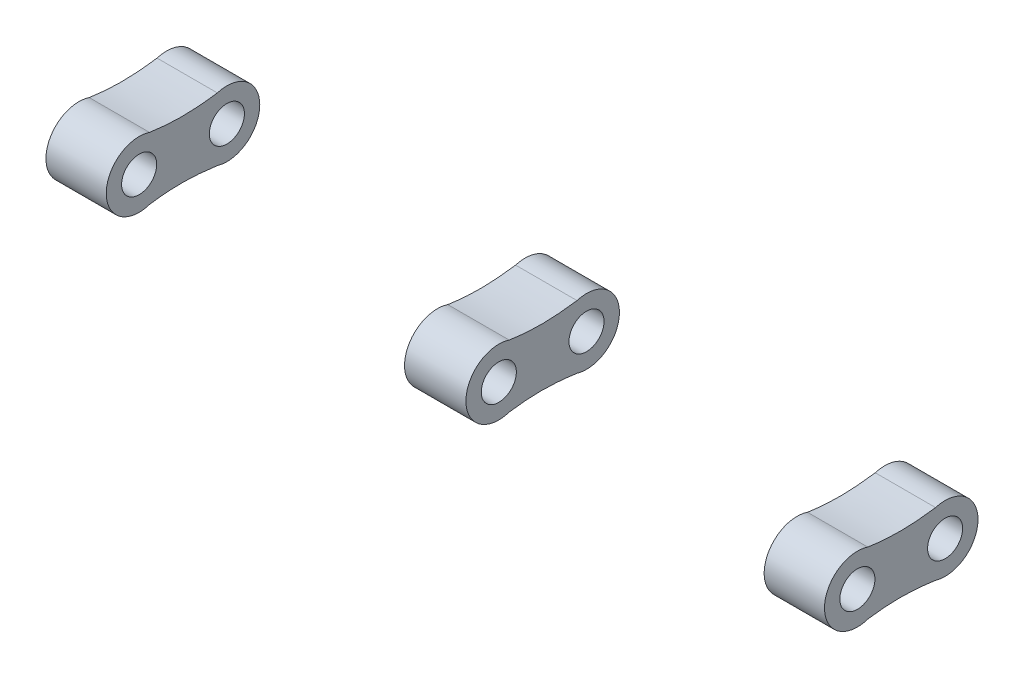
ISO-10303-21;
HEADER;
FILE_DESCRIPTION(('STEP AP214'),'2;1');
FILE_NAME('part.step','',(''),(''),'','','');
FILE_SCHEMA(('AUTOMOTIVE_DESIGN { 1 0 10303 214 1 1 1 1 }'));
ENDSEC;
DATA;
#1=APPLICATION_CONTEXT('core data for automotive mechanical design processes');
#2=APPLICATION_PROTOCOL_DEFINITION('international standard','automotive_design',2000,#1);
#3=PRODUCT_CONTEXT('',#1,'mechanical');
#4=PRODUCT('Part','Part','',(#3));
#5=PRODUCT_RELATED_PRODUCT_CATEGORY('part','',(#4));
#6=PRODUCT_DEFINITION_FORMATION('','',#4);
#7=PRODUCT_DEFINITION_CONTEXT('part definition',#1,'design');
#8=PRODUCT_DEFINITION('design','',#6,#7);
#9=PRODUCT_DEFINITION_SHAPE('','',#8);
#10=(LENGTH_UNIT() NAMED_UNIT(*) SI_UNIT(.MILLI.,.METRE.));
#11=(NAMED_UNIT(*) PLANE_ANGLE_UNIT() SI_UNIT($,.RADIAN.));
#12=(NAMED_UNIT(*) SI_UNIT($,.STERADIAN.) SOLID_ANGLE_UNIT());
#13=UNCERTAINTY_MEASURE_WITH_UNIT(LENGTH_MEASURE(1.E-05),#10,'distance_accuracy_value','');
#14=(GEOMETRIC_REPRESENTATION_CONTEXT(3) GLOBAL_UNCERTAINTY_ASSIGNED_CONTEXT((#13)) GLOBAL_UNIT_ASSIGNED_CONTEXT((#10,
#11,#12)) REPRESENTATION_CONTEXT('',''));
#15=CARTESIAN_POINT('',(0.,0.,0.));
#16=DIRECTION('',(0.,0.,1.));
#17=DIRECTION('',(1.,0.,0.));
#18=AXIS2_PLACEMENT_3D('',#15,#16,#17);
#19=CARTESIAN_POINT('',(4.50788655293066,0.,-3.5));
#20=DIRECTION('',(-1.,0.,0.));
#21=DIRECTION('',(0.,0.,1.));
#22=AXIS2_PLACEMENT_3D('',#19,#20,#21);
#23=CYLINDRICAL_SURFACE('',#22,0.4);
#24=CARTESIAN_POINT('',(-0.7,0.,-3.5));
#25=DIRECTION('',(1.,0.,0.));
#26=DIRECTION('',(0.,0.,-1.));
#27=AXIS2_PLACEMENT_3D('',#24,#25,#26);
#28=CIRCLE('',#27,0.4);
#29=CARTESIAN_POINT('',(-0.7,0.,-3.9));
#30=VERTEX_POINT('',#29);
#31=EDGE_CURVE('E123',#30,#30,#28,.T.);
#32=ORIENTED_EDGE('',*,*,#31,.F.);
#33=EDGE_LOOP('',(#32));
#34=FACE_BOUND('',#33,.T.);
#35=CARTESIAN_POINT('',(0.7,0.,-3.5));
#36=DIRECTION('',(1.,0.,0.));
#37=DIRECTION('',(0.,0.,-1.));
#38=AXIS2_PLACEMENT_3D('',#35,#36,#37);
#39=CIRCLE('',#38,0.4);
#40=CARTESIAN_POINT('',(0.7,0.,-3.9));
#41=VERTEX_POINT('',#40);
#42=EDGE_CURVE('E104',#41,#41,#39,.T.);
#43=ORIENTED_EDGE('',*,*,#42,.T.);
#44=EDGE_LOOP('',(#43));
#45=FACE_BOUND('',#44,.T.);
#46=ADVANCED_FACE('F43',(#34,#45),#23,.F.);
#47=CARTESIAN_POINT('',(4.50788655293066,0.,-3.5));
#48=DIRECTION('',(-1.,0.,0.));
#49=DIRECTION('',(0.,0.,1.));
#50=AXIS2_PLACEMENT_3D('',#47,#48,#49);
#51=CYLINDRICAL_SURFACE('',#50,0.749999999998612);
#52=CARTESIAN_POINT('',(0.7,0.,-3.5));
#53=DIRECTION('',(1.,0.,0.));
#54=DIRECTION('',(0.,0.,-1.));
#55=AXIS2_PLACEMENT_3D('',#52,#53,#54);
#56=CIRCLE('',#55,0.749999999998612);
#57=CARTESIAN_POINT('',(0.7,-0.71798439311027,-3.28320883032744));
#58=VERTEX_POINT('',#57);
#59=CARTESIAN_POINT('',(0.7,0.717984393110274,-3.28320883032746));
#60=VERTEX_POINT('',#59);
#61=EDGE_CURVE('E89',#58,#60,#56,.T.);
#62=ORIENTED_EDGE('',*,*,#61,.F.);
#63=DIRECTION('',(-1.,0.,0.));
#64=VECTOR('',#63,1.);
#65=CARTESIAN_POINT('',(4.50788655293066,-0.71798439311027,-3.28320883032744));
#66=LINE('',#65,#64);
#67=CARTESIAN_POINT('',(-0.7,-0.71798439311027,-3.28320883032744));
#68=VERTEX_POINT('',#67);
#69=EDGE_CURVE('E60',#58,#68,#66,.T.);
#70=ORIENTED_EDGE('',*,*,#69,.T.);
#71=CARTESIAN_POINT('',(-0.7,0.,-3.5));
#72=DIRECTION('',(1.,0.,0.));
#73=DIRECTION('',(0.,0.,-1.));
#74=AXIS2_PLACEMENT_3D('',#71,#72,#73);
#75=CIRCLE('',#74,0.749999999998612);
#76=CARTESIAN_POINT('',(-0.7,0.717984393110274,-3.28320883032746));
#77=VERTEX_POINT('',#76);
#78=EDGE_CURVE('E92',#68,#77,#75,.T.);
#79=ORIENTED_EDGE('',*,*,#78,.T.);
#80=DIRECTION('',(-1.,0.,0.));
#81=VECTOR('',#80,1.);
#82=CARTESIAN_POINT('',(4.50788655293066,0.717984393110274,-3.28320883032746));
#83=LINE('',#82,#81);
#84=EDGE_CURVE('E85',#60,#77,#83,.T.);
#85=ORIENTED_EDGE('',*,*,#84,.F.);
#86=EDGE_LOOP('',(#62,#70,#79,#85));
#87=FACE_BOUND('',#86,.T.);
#88=ADVANCED_FACE('F87',(#87),#51,.T.);
#89=CARTESIAN_POINT('',(4.50788655293066,-0.711356359117423,-1.7376386549852));
#90=CARTESIAN_POINT('',(4.50788655293066,-0.628628531625832,-2.30473789186206));
#91=CARTESIAN_POINT('',(4.50788655293066,-0.640882332408788,-2.7257143253079));
#92=CARTESIAN_POINT('',(4.50788655293066,-0.71798439311027,-3.28320883032744));
#93=B_SPLINE_CURVE_WITH_KNOTS('',3,(#89,#90,#91,#92),.UNSPECIFIED.,.F.,.F.,(4,4),
(0.106827286541516,0.900451134751873),.UNSPECIFIED.);
#94=DIRECTION('',(-1.,0.,0.));
#95=VECTOR('',#94,1.);
#96=SURFACE_OF_LINEAR_EXTRUSION('',#93,#95);
#97=CARTESIAN_POINT('',(0.7,-0.711356359117423,-1.7376386549852));
#98=CARTESIAN_POINT('',(0.7,-0.628628531625832,-2.30473789186206));
#99=CARTESIAN_POINT('',(0.7,-0.640882332408788,-2.7257143253079));
#100=CARTESIAN_POINT('',(0.7,-0.71798439311027,-3.28320883032744));
#101=B_SPLINE_CURVE_WITH_KNOTS('',3,(#97,#98,#99,#100),.UNSPECIFIED.,.F.,.F.,(4,4),
(0.106827286541516,0.900451134751873),.UNSPECIFIED.);
#102=CARTESIAN_POINT('',(0.7,-0.711356359117431,-1.73763865498521));
#103=VERTEX_POINT('',#102);
#104=EDGE_CURVE('E103',#103,#58,#101,.T.);
#105=ORIENTED_EDGE('',*,*,#104,.F.);
#106=DIRECTION('',(-1.,0.,0.));
#107=VECTOR('',#106,1.);
#108=CARTESIAN_POINT('',(4.50788655293066,-0.711356359117431,-1.73763865498521));
#109=LINE('',#108,#107);
#110=CARTESIAN_POINT('',(-0.7,-0.711356359117431,-1.73763865498521));
#111=VERTEX_POINT('',#110);
#112=EDGE_CURVE('E53',#103,#111,#109,.T.);
#113=ORIENTED_EDGE('',*,*,#112,.T.);
#114=CARTESIAN_POINT('',(-0.7,-0.711356359117423,-1.7376386549852));
#115=CARTESIAN_POINT('',(-0.7,-0.628628531625832,-2.30473789186206));
#116=CARTESIAN_POINT('',(-0.7,-0.640882332408788,-2.7257143253079));
#117=CARTESIAN_POINT('',(-0.7,-0.71798439311027,-3.28320883032744));
#118=B_SPLINE_CURVE_WITH_KNOTS('',3,(#114,#115,#116,#117),.UNSPECIFIED.,.F.,.F.,(4,4),
(0.106827286541516,0.900451134751873),.UNSPECIFIED.);
#119=EDGE_CURVE('E227',#111,#68,#118,.T.);
#120=ORIENTED_EDGE('',*,*,#119,.T.);
#121=ORIENTED_EDGE('',*,*,#69,.F.);
#122=EDGE_LOOP('',(#105,#113,#120,#121));
#123=FACE_BOUND('',#122,.T.);
#124=ADVANCED_FACE('F144',(#123),#96,.F.);
#125=CARTESIAN_POINT('',(4.50788655293066,0.,-1.5));
#126=DIRECTION('',(-1.,0.,0.));
#127=DIRECTION('',(0.,0.,1.));
#128=AXIS2_PLACEMENT_3D('',#125,#126,#127);
#129=CYLINDRICAL_SURFACE('',#128,0.749999999999991);
#130=CARTESIAN_POINT('',(0.7,0.,-1.5));
#131=DIRECTION('',(1.,0.,0.));
#132=DIRECTION('',(0.,0.,-1.));
#133=AXIS2_PLACEMENT_3D('',#130,#131,#132);
#134=CIRCLE('',#133,0.749999999999991);
#135=CARTESIAN_POINT('',(0.7,0.7113563591174,-1.7376386549853));
#136=VERTEX_POINT('',#135);
#137=EDGE_CURVE('E67',#136,#103,#134,.T.);
#138=ORIENTED_EDGE('',*,*,#137,.F.);
#139=DIRECTION('',(-1.,0.,0.));
#140=VECTOR('',#139,1.);
#141=CARTESIAN_POINT('',(4.50788655293066,0.7113563591174,-1.7376386549853));
#142=LINE('',#141,#140);
#143=CARTESIAN_POINT('',(-0.7,0.7113563591174,-1.7376386549853));
#144=VERTEX_POINT('',#143);
#145=EDGE_CURVE('E12',#136,#144,#142,.T.);
#146=ORIENTED_EDGE('',*,*,#145,.T.);
#147=CARTESIAN_POINT('',(-0.7,0.,-1.5));
#148=DIRECTION('',(1.,0.,0.));
#149=DIRECTION('',(0.,0.,-1.));
#150=AXIS2_PLACEMENT_3D('',#147,#148,#149);
#151=CIRCLE('',#150,0.749999999999991);
#152=EDGE_CURVE('E226',#144,#111,#151,.T.);
#153=ORIENTED_EDGE('',*,*,#152,.T.);
#154=ORIENTED_EDGE('',*,*,#112,.F.);
#155=EDGE_LOOP('',(#138,#146,#153,#154));
#156=FACE_BOUND('',#155,.T.);
#157=ADVANCED_FACE('F147',(#156),#129,.T.);
#158=CARTESIAN_POINT('',(4.50788655293066,0.717984393110272,-3.28320883032746));
#159=CARTESIAN_POINT('',(4.50788655293066,0.640882332408786,-2.72571432530796));
#160=CARTESIAN_POINT('',(4.50788655293066,0.628628531625817,-2.30473789186215));
#161=CARTESIAN_POINT('',(4.50788655293066,0.711356359117408,-1.7376386549853));
#162=B_SPLINE_CURVE_WITH_KNOTS('',3,(#158,#159,#160,#161),.UNSPECIFIED.,.F.,.F.,(4,4),
(0.106827286541515,0.900451134751871),.UNSPECIFIED.);
#163=DIRECTION('',(-1.,0.,0.));
#164=VECTOR('',#163,1.);
#165=SURFACE_OF_LINEAR_EXTRUSION('',#162,#164);
#166=CARTESIAN_POINT('',(0.700000000000001,0.717984393110272,-3.28320883032746));
#167=CARTESIAN_POINT('',(0.700000000000001,0.640882332408786,-2.72571432530796));
#168=CARTESIAN_POINT('',(0.700000000000001,0.628628531625817,-2.30473789186215));
#169=CARTESIAN_POINT('',(0.700000000000001,0.711356359117408,-1.7376386549853));
#170=B_SPLINE_CURVE_WITH_KNOTS('',3,(#166,#167,#168,#169),.UNSPECIFIED.,.F.,.F.,(4,4),
(0.106827286541515,0.900451134751871),.UNSPECIFIED.);
#171=EDGE_CURVE('E98',#60,#136,#170,.T.);
#172=ORIENTED_EDGE('',*,*,#171,.F.);
#173=ORIENTED_EDGE('',*,*,#84,.T.);
#174=CARTESIAN_POINT('',(-0.7,0.717984393110272,-3.28320883032746));
#175=CARTESIAN_POINT('',(-0.7,0.640882332408786,-2.72571432530796));
#176=CARTESIAN_POINT('',(-0.7,0.628628531625817,-2.30473789186215));
#177=CARTESIAN_POINT('',(-0.7,0.711356359117408,-1.7376386549853));
#178=B_SPLINE_CURVE_WITH_KNOTS('',3,(#174,#175,#176,#177),.UNSPECIFIED.,.F.,.F.,(4,4),
(0.106827286541515,0.900451134751871),.UNSPECIFIED.);
#179=EDGE_CURVE('E125',#77,#144,#178,.T.);
#180=ORIENTED_EDGE('',*,*,#179,.T.);
#181=ORIENTED_EDGE('',*,*,#145,.F.);
#182=EDGE_LOOP('',(#172,#173,#180,#181));
#183=FACE_BOUND('',#182,.T.);
#184=ADVANCED_FACE('F45',(#183),#165,.F.);
#185=CARTESIAN_POINT('',(-0.7,0.654734168041436,-2.51402551710288));
#186=DIRECTION('',(1.,0.,0.));
#187=DIRECTION('',(0.,0.,-1.));
#188=AXIS2_PLACEMENT_3D('',#185,#186,#187);
#189=PLANE('',#188);
#190=ORIENTED_EDGE('',*,*,#179,.F.);
#191=ORIENTED_EDGE('',*,*,#78,.F.);
#192=ORIENTED_EDGE('',*,*,#119,.F.);
#193=ORIENTED_EDGE('',*,*,#152,.F.);
#194=EDGE_LOOP('',(#190,#191,#192,#193));
#195=FACE_BOUND('',#194,.T.);
#196=ORIENTED_EDGE('',*,*,#31,.T.);
#197=EDGE_LOOP('',(#196));
#198=FACE_BOUND('',#197,.T.);
#199=CARTESIAN_POINT('',(-0.7,0.,-1.5));
#200=DIRECTION('',(1.,0.,0.));
#201=DIRECTION('',(0.,0.,-1.));
#202=AXIS2_PLACEMENT_3D('',#199,#200,#201);
#203=CIRCLE('',#202,0.4);
#204=CARTESIAN_POINT('',(-0.7,0.,-1.9));
#205=VERTEX_POINT('',#204);
#206=EDGE_CURVE('E100',#205,#205,#203,.T.);
#207=ORIENTED_EDGE('',*,*,#206,.T.);
#208=EDGE_LOOP('',(#207));
#209=FACE_BOUND('',#208,.T.);
#210=ADVANCED_FACE('F153',(#195,#198,#209),#189,.F.);
#211=CARTESIAN_POINT('',(4.50788655293066,0.,-1.5));
#212=DIRECTION('',(-1.,0.,0.));
#213=DIRECTION('',(0.,0.,1.));
#214=AXIS2_PLACEMENT_3D('',#211,#212,#213);
#215=CYLINDRICAL_SURFACE('',#214,0.4);
#216=ORIENTED_EDGE('',*,*,#206,.F.);
#217=EDGE_LOOP('',(#216));
#218=FACE_BOUND('',#217,.T.);
#219=CARTESIAN_POINT('',(0.7,0.,-1.5));
#220=DIRECTION('',(1.,0.,0.));
#221=DIRECTION('',(0.,0.,-1.));
#222=AXIS2_PLACEMENT_3D('',#219,#220,#221);
#223=CIRCLE('',#222,0.4);
#224=CARTESIAN_POINT('',(0.7,0.,-1.9));
#225=VERTEX_POINT('',#224);
#226=EDGE_CURVE('E48',#225,#225,#223,.T.);
#227=ORIENTED_EDGE('',*,*,#226,.T.);
#228=EDGE_LOOP('',(#227));
#229=FACE_BOUND('',#228,.T.);
#230=ADVANCED_FACE('F163',(#218,#229),#215,.F.);
#231=CARTESIAN_POINT('',(0.7,-10.,-5.));
#232=DIRECTION('',(1.,0.,0.));
#233=DIRECTION('',(0.,0.,-1.));
#234=AXIS2_PLACEMENT_3D('',#231,#232,#233);
#235=PLANE('',#234);
#236=ORIENTED_EDGE('',*,*,#226,.F.);
#237=EDGE_LOOP('',(#236));
#238=FACE_BOUND('',#237,.T.);
#239=ORIENTED_EDGE('',*,*,#42,.F.);
#240=EDGE_LOOP('',(#239));
#241=FACE_BOUND('',#240,.T.);
#242=ORIENTED_EDGE('',*,*,#61,.T.);
#243=ORIENTED_EDGE('',*,*,#171,.T.);
#244=ORIENTED_EDGE('',*,*,#137,.T.);
#245=ORIENTED_EDGE('',*,*,#104,.T.);
#246=EDGE_LOOP('',(#242,#243,#244,#245));
#247=FACE_BOUND('',#246,.T.);
#248=ADVANCED_FACE('F102',(#238,#241,#247),#235,.T.);
#249=CLOSED_SHELL('',(#46,#88,#124,#157,#184,#210,#230,#248));
#250=MANIFOLD_SOLID_BREP('B2',#249);
#251=CARTESIAN_POINT('',(-7.5,-0.654734168041444,-2.51402551710281));
#252=DIRECTION('',(-1.,0.,0.));
#253=DIRECTION('',(0.,0.,1.));
#254=AXIS2_PLACEMENT_3D('',#251,#252,#253);
#255=PLANE('',#254);
#256=CARTESIAN_POINT('',(-7.5,-0.71798439311027,-3.28320883032744));
#257=CARTESIAN_POINT('',(-7.5,-0.640882332408788,-2.7257143253079));
#258=CARTESIAN_POINT('',(-7.5,-0.628628531625832,-2.30473789186206));
#259=CARTESIAN_POINT('',(-7.5,-0.711356359117423,-1.7376386549852));
#260=B_SPLINE_CURVE_WITH_KNOTS('',3,(#256,#257,#258,#259),.UNSPECIFIED.,.F.,.F.,(4,4),
(0.106827286541516,0.900451134751873),.UNSPECIFIED.);
#261=CARTESIAN_POINT('',(-7.5,-0.717984393110269,-3.28320883032744));
#262=VERTEX_POINT('',#261);
#263=CARTESIAN_POINT('',(-7.5,-0.711356359117431,-1.73763865498521));
#264=VERTEX_POINT('',#263);
#265=EDGE_CURVE('E310',#262,#264,#260,.T.);
#266=ORIENTED_EDGE('',*,*,#265,.F.);
#267=CARTESIAN_POINT('',(-7.5,0.,-3.5));
#268=DIRECTION('',(-1.,0.,0.));
#269=DIRECTION('',(0.,0.,1.));
#270=AXIS2_PLACEMENT_3D('',#267,#268,#269);
#271=CIRCLE('',#270,0.749999999998611);
#272=CARTESIAN_POINT('',(-7.5,0.717984393110272,-3.28320883032746));
#273=VERTEX_POINT('',#272);
#274=EDGE_CURVE('E336',#273,#262,#271,.T.);
#275=ORIENTED_EDGE('',*,*,#274,.F.);
#276=CARTESIAN_POINT('',(-7.5,0.711356359117408,-1.7376386549853));
#277=CARTESIAN_POINT('',(-7.5,0.628628531625817,-2.30473789186215));
#278=CARTESIAN_POINT('',(-7.5,0.640882332408786,-2.72571432530796));
#279=CARTESIAN_POINT('',(-7.5,0.717984393110272,-3.28320883032746));
#280=B_SPLINE_CURVE_WITH_KNOTS('',3,(#276,#277,#278,#279),.UNSPECIFIED.,.F.,.F.,(4,4),
(0.106827286541515,0.900451134751871),.UNSPECIFIED.);
#281=CARTESIAN_POINT('',(-7.5,0.7113563591174,-1.7376386549853));
#282=VERTEX_POINT('',#281);
#283=EDGE_CURVE('E311',#282,#273,#280,.T.);
#284=ORIENTED_EDGE('',*,*,#283,.F.);
#285=CARTESIAN_POINT('',(-7.5,0.,-1.5));
#286=DIRECTION('',(-1.,0.,0.));
#287=DIRECTION('',(0.,0.,1.));
#288=AXIS2_PLACEMENT_3D('',#285,#286,#287);
#289=CIRCLE('',#288,0.749999999999991);
#290=EDGE_CURVE('E300',#264,#282,#289,.T.);
#291=ORIENTED_EDGE('',*,*,#290,.F.);
#292=EDGE_LOOP('',(#266,#275,#284,#291));
#293=FACE_BOUND('',#292,.T.);
#294=CARTESIAN_POINT('',(-7.5,0.,-3.5));
#295=DIRECTION('',(-1.,0.,0.));
#296=DIRECTION('',(0.,0.,1.));
#297=AXIS2_PLACEMENT_3D('',#294,#295,#296);
#298=CIRCLE('',#297,0.4);
#299=CARTESIAN_POINT('',(-7.5,0.,-3.1));
#300=VERTEX_POINT('',#299);
#301=EDGE_CURVE('E325',#300,#300,#298,.T.);
#302=ORIENTED_EDGE('',*,*,#301,.T.);
#303=EDGE_LOOP('',(#302));
#304=FACE_BOUND('',#303,.T.);
#305=CARTESIAN_POINT('',(-7.5,0.,-1.5));
#306=DIRECTION('',(-1.,0.,0.));
#307=DIRECTION('',(0.,0.,1.));
#308=AXIS2_PLACEMENT_3D('',#305,#306,#307);
#309=CIRCLE('',#308,0.4);
#310=CARTESIAN_POINT('',(-7.5,0.,-1.1));
#311=VERTEX_POINT('',#310);
#312=EDGE_CURVE('E331',#311,#311,#309,.T.);
#313=ORIENTED_EDGE('',*,*,#312,.T.);
#314=EDGE_LOOP('',(#313));
#315=FACE_BOUND('',#314,.T.);
#316=ADVANCED_FACE('F251',(#293,#304,#315),#255,.F.);
#317=CARTESIAN_POINT('',(-12.6828865529307,-0.71798439311027,-3.28320883032744));
#318=CARTESIAN_POINT('',(-12.6828865529307,-0.640882332408788,-2.7257143253079));
#319=CARTESIAN_POINT('',(-12.6828865529307,-0.628628531625832,-2.30473789186206));
#320=CARTESIAN_POINT('',(-12.6828865529307,-0.711356359117423,-1.7376386549852));
#321=B_SPLINE_CURVE_WITH_KNOTS('',3,(#317,#318,#319,#320),.UNSPECIFIED.,.F.,.F.,(4,4),
(0.106827286541516,0.900451134751873),.UNSPECIFIED.);
#322=DIRECTION('',(1.,0.,0.));
#323=VECTOR('',#322,1.);
#324=SURFACE_OF_LINEAR_EXTRUSION('',#321,#323);
#325=DIRECTION('',(1.,0.,0.));
#326=VECTOR('',#325,1.);
#327=CARTESIAN_POINT('',(-12.6828865529307,-0.711356359117431,-1.73763865498521));
#328=LINE('',#327,#326);
#329=CARTESIAN_POINT('',(-8.875,-0.711356359117431,-1.73763865498521));
#330=VERTEX_POINT('',#329);
#331=EDGE_CURVE('E297',#330,#264,#328,.T.);
#332=ORIENTED_EDGE('',*,*,#331,.F.);
#333=CARTESIAN_POINT('',(-8.875,-0.71798439311027,-3.28320883032744));
#334=CARTESIAN_POINT('',(-8.875,-0.640882332408788,-2.7257143253079));
#335=CARTESIAN_POINT('',(-8.875,-0.628628531625832,-2.30473789186206));
#336=CARTESIAN_POINT('',(-8.875,-0.711356359117423,-1.7376386549852));
#337=B_SPLINE_CURVE_WITH_KNOTS('',3,(#333,#334,#335,#336),.UNSPECIFIED.,.F.,.F.,(4,4),
(0.106827286541516,0.900451134751873),.UNSPECIFIED.);
#338=CARTESIAN_POINT('',(-8.875,-0.717984393110269,-3.28320883032744));
#339=VERTEX_POINT('',#338);
#340=EDGE_CURVE('E272',#330,#339,#337,.F.);
#341=ORIENTED_EDGE('',*,*,#340,.T.);
#342=DIRECTION('',(1.,0.,0.));
#343=VECTOR('',#342,1.);
#344=CARTESIAN_POINT('',(-12.6828865529307,-0.717984393110269,-3.28320883032744));
#345=LINE('',#344,#343);
#346=EDGE_CURVE('E316',#339,#262,#345,.T.);
#347=ORIENTED_EDGE('',*,*,#346,.T.);
#348=ORIENTED_EDGE('',*,*,#265,.T.);
#349=EDGE_LOOP('',(#332,#341,#347,#348));
#350=FACE_BOUND('',#349,.T.);
#351=ADVANCED_FACE('F314',(#350),#324,.F.);
#352=CARTESIAN_POINT('',(-12.6828865529307,0.,-1.5));
#353=DIRECTION('',(1.,0.,0.));
#354=DIRECTION('',(0.,0.,-1.));
#355=AXIS2_PLACEMENT_3D('',#352,#353,#354);
#356=CYLINDRICAL_SURFACE('',#355,0.749999999999991);
#357=DIRECTION('',(1.,0.,0.));
#358=VECTOR('',#357,1.);
#359=CARTESIAN_POINT('',(-12.6828865529307,0.7113563591174,-1.7376386549853));
#360=LINE('',#359,#358);
#361=CARTESIAN_POINT('',(-8.875,0.711356359117408,-1.7376386549853));
#362=VERTEX_POINT('',#361);
#363=EDGE_CURVE('E292',#362,#282,#360,.T.);
#364=ORIENTED_EDGE('',*,*,#363,.F.);
#365=CARTESIAN_POINT('',(-8.875,0.,-1.5));
#366=DIRECTION('',(1.,0.,0.));
#367=DIRECTION('',(0.,0.,-1.));
#368=AXIS2_PLACEMENT_3D('',#365,#366,#367);
#369=CIRCLE('',#368,0.749999999999991);
#370=EDGE_CURVE('E302',#362,#330,#369,.T.);
#371=ORIENTED_EDGE('',*,*,#370,.T.);
#372=ORIENTED_EDGE('',*,*,#331,.T.);
#373=ORIENTED_EDGE('',*,*,#290,.T.);
#374=EDGE_LOOP('',(#364,#371,#372,#373));
#375=FACE_BOUND('',#374,.T.);
#376=ADVANCED_FACE('F299',(#375),#356,.T.);
#377=CARTESIAN_POINT('',(-12.6828865529307,0.711356359117408,-1.7376386549853));
#378=CARTESIAN_POINT('',(-12.6828865529307,0.628628531625817,-2.30473789186215));
#379=CARTESIAN_POINT('',(-12.6828865529307,0.640882332408786,-2.72571432530796));
#380=CARTESIAN_POINT('',(-12.6828865529307,0.717984393110272,-3.28320883032746));
#381=B_SPLINE_CURVE_WITH_KNOTS('',3,(#377,#378,#379,#380),.UNSPECIFIED.,.F.,.F.,(4,4),
(0.106827286541515,0.900451134751871),.UNSPECIFIED.);
#382=DIRECTION('',(1.,0.,0.));
#383=VECTOR('',#382,1.);
#384=SURFACE_OF_LINEAR_EXTRUSION('',#381,#383);
#385=DIRECTION('',(1.,0.,0.));
#386=VECTOR('',#385,1.);
#387=CARTESIAN_POINT('',(-12.6828865529307,0.717984393110272,-3.28320883032746));
#388=LINE('',#387,#386);
#389=CARTESIAN_POINT('',(-8.875,0.717984393110272,-3.28320883032746));
#390=VERTEX_POINT('',#389);
#391=EDGE_CURVE('E335',#390,#273,#388,.T.);
#392=ORIENTED_EDGE('',*,*,#391,.F.);
#393=CARTESIAN_POINT('',(-8.875,0.711356359117408,-1.7376386549853));
#394=CARTESIAN_POINT('',(-8.875,0.628628531625817,-2.30473789186215));
#395=CARTESIAN_POINT('',(-8.875,0.640882332408786,-2.72571432530796));
#396=CARTESIAN_POINT('',(-8.875,0.717984393110272,-3.28320883032746));
#397=B_SPLINE_CURVE_WITH_KNOTS('',3,(#393,#394,#395,#396),.UNSPECIFIED.,.F.,.F.,(4,4),
(0.106827286541515,0.900451134751871),.UNSPECIFIED.);
#398=EDGE_CURVE('E312',#390,#362,#397,.F.);
#399=ORIENTED_EDGE('',*,*,#398,.T.);
#400=ORIENTED_EDGE('',*,*,#363,.T.);
#401=ORIENTED_EDGE('',*,*,#283,.T.);
#402=EDGE_LOOP('',(#392,#399,#400,#401));
#403=FACE_BOUND('',#402,.T.);
#404=ADVANCED_FACE('F361',(#403),#384,.F.);
#405=CARTESIAN_POINT('',(-12.6828865529307,0.,-3.5));
#406=DIRECTION('',(1.,0.,0.));
#407=DIRECTION('',(0.,0.,-1.));
#408=AXIS2_PLACEMENT_3D('',#405,#406,#407);
#409=CYLINDRICAL_SURFACE('',#408,0.749999999998611);
#410=ORIENTED_EDGE('',*,*,#346,.F.);
#411=CARTESIAN_POINT('',(-8.875,0.,-3.5));
#412=DIRECTION('',(1.,0.,0.));
#413=DIRECTION('',(0.,0.,-1.));
#414=AXIS2_PLACEMENT_3D('',#411,#412,#413);
#415=CIRCLE('',#414,0.749999999998611);
#416=EDGE_CURVE('E337',#339,#390,#415,.T.);
#417=ORIENTED_EDGE('',*,*,#416,.T.);
#418=ORIENTED_EDGE('',*,*,#391,.T.);
#419=ORIENTED_EDGE('',*,*,#274,.T.);
#420=EDGE_LOOP('',(#410,#417,#418,#419));
#421=FACE_BOUND('',#420,.T.);
#422=ADVANCED_FACE('F365',(#421),#409,.T.);
#423=CARTESIAN_POINT('',(-12.6828865529307,0.,-3.5));
#424=DIRECTION('',(1.,0.,0.));
#425=DIRECTION('',(0.,0.,-1.));
#426=AXIS2_PLACEMENT_3D('',#423,#424,#425);
#427=CYLINDRICAL_SURFACE('',#426,0.4);
#428=CARTESIAN_POINT('',(-8.875,0.,-3.5));
#429=DIRECTION('',(1.,0.,0.));
#430=DIRECTION('',(0.,0.,-1.));
#431=AXIS2_PLACEMENT_3D('',#428,#429,#430);
#432=CIRCLE('',#431,0.4);
#433=CARTESIAN_POINT('',(-8.875,0.,-3.9));
#434=VERTEX_POINT('',#433);
#435=EDGE_CURVE('E41',#434,#434,#432,.T.);
#436=ORIENTED_EDGE('',*,*,#435,.F.);
#437=EDGE_LOOP('',(#436));
#438=FACE_BOUND('',#437,.T.);
#439=ORIENTED_EDGE('',*,*,#301,.F.);
#440=EDGE_LOOP('',(#439));
#441=FACE_BOUND('',#440,.T.);
#442=ADVANCED_FACE('F371',(#438,#441),#427,.F.);
#443=CARTESIAN_POINT('',(-12.6828865529307,0.,-1.5));
#444=DIRECTION('',(1.,0.,0.));
#445=DIRECTION('',(0.,0.,-1.));
#446=AXIS2_PLACEMENT_3D('',#443,#444,#445);
#447=CYLINDRICAL_SURFACE('',#446,0.4);
#448=CARTESIAN_POINT('',(-8.875,0.,-1.5));
#449=DIRECTION('',(1.,0.,0.));
#450=DIRECTION('',(0.,0.,-1.));
#451=AXIS2_PLACEMENT_3D('',#448,#449,#450);
#452=CIRCLE('',#451,0.4);
#453=CARTESIAN_POINT('',(-8.875,0.,-1.9));
#454=VERTEX_POINT('',#453);
#455=EDGE_CURVE('E263',#454,#454,#452,.T.);
#456=ORIENTED_EDGE('',*,*,#455,.F.);
#457=EDGE_LOOP('',(#456));
#458=FACE_BOUND('',#457,.T.);
#459=ORIENTED_EDGE('',*,*,#312,.F.);
#460=EDGE_LOOP('',(#459));
#461=FACE_BOUND('',#460,.T.);
#462=ADVANCED_FACE('F373',(#458,#461),#447,.F.);
#463=CARTESIAN_POINT('',(-8.875,0.,-3.5));
#464=DIRECTION('',(1.,0.,0.));
#465=DIRECTION('',(0.,0.,-1.));
#466=AXIS2_PLACEMENT_3D('',#463,#464,#465);
#467=PLANE('',#466);
#468=ORIENTED_EDGE('',*,*,#455,.T.);
#469=EDGE_LOOP('',(#468));
#470=FACE_BOUND('',#469,.T.);
#471=ORIENTED_EDGE('',*,*,#435,.T.);
#472=EDGE_LOOP('',(#471));
#473=FACE_BOUND('',#472,.T.);
#474=ORIENTED_EDGE('',*,*,#370,.F.);
#475=ORIENTED_EDGE('',*,*,#398,.F.);
#476=ORIENTED_EDGE('',*,*,#416,.F.);
#477=ORIENTED_EDGE('',*,*,#340,.F.);
#478=EDGE_LOOP('',(#474,#475,#476,#477));
#479=FACE_BOUND('',#478,.T.);
#480=ADVANCED_FACE('F253',(#470,#473,#479),#467,.F.);
#481=CLOSED_SHELL('',(#316,#351,#376,#404,#422,#442,#462,#480));
#482=MANIFOLD_SOLID_BREP('B6',#481);
#483=CARTESIAN_POINT('',(3.69211344706934,0.,-1.5));
#484=DIRECTION('',(1.,0.,0.));
#485=DIRECTION('',(0.,0.,-1.));
#486=AXIS2_PLACEMENT_3D('',#483,#484,#485);
#487=CYLINDRICAL_SURFACE('',#486,0.749999999999991);
#488=CARTESIAN_POINT('',(7.5,0.,-1.5));
#489=DIRECTION('',(1.,0.,0.));
#490=DIRECTION('',(0.,0.,-1.));
#491=AXIS2_PLACEMENT_3D('',#488,#489,#490);
#492=CIRCLE('',#491,0.749999999999991);
#493=CARTESIAN_POINT('',(7.5,-0.711356359117423,-1.7376386549852));
#494=VERTEX_POINT('',#493);
#495=CARTESIAN_POINT('',(7.5,0.7113563591174,-1.7376386549853));
#496=VERTEX_POINT('',#495);
#497=EDGE_CURVE('E544',#494,#496,#492,.F.);
#498=ORIENTED_EDGE('',*,*,#497,.F.);
#499=DIRECTION('',(1.,0.,0.));
#500=VECTOR('',#499,1.);
#501=CARTESIAN_POINT('',(3.69211344706934,-0.711356359117423,-1.7376386549852));
#502=LINE('',#501,#500);
#503=CARTESIAN_POINT('',(8.875,-0.711356359117423,-1.7376386549852));
#504=VERTEX_POINT('',#503);
#505=EDGE_CURVE('E497',#494,#504,#502,.T.);
#506=ORIENTED_EDGE('',*,*,#505,.T.);
#507=CARTESIAN_POINT('',(8.875,0.,-1.5));
#508=DIRECTION('',(1.,0.,0.));
#509=DIRECTION('',(0.,0.,-1.));
#510=AXIS2_PLACEMENT_3D('',#507,#508,#509);
#511=CIRCLE('',#510,0.749999999999991);
#512=CARTESIAN_POINT('',(8.875,0.7113563591174,-1.7376386549853));
#513=VERTEX_POINT('',#512);
#514=EDGE_CURVE('E500',#513,#504,#511,.T.);
#515=ORIENTED_EDGE('',*,*,#514,.F.);
#516=DIRECTION('',(1.,0.,0.));
#517=VECTOR('',#516,1.);
#518=CARTESIAN_POINT('',(3.69211344706934,0.7113563591174,-1.7376386549853));
#519=LINE('',#518,#517);
#520=EDGE_CURVE('E489',#496,#513,#519,.T.);
#521=ORIENTED_EDGE('',*,*,#520,.F.);
#522=EDGE_LOOP('',(#498,#506,#515,#521));
#523=FACE_BOUND('',#522,.T.);
#524=ADVANCED_FACE('F450',(#523),#487,.T.);
#525=CARTESIAN_POINT('',(3.69211344706934,-0.711356359117423,-1.7376386549852));
#526=CARTESIAN_POINT('',(3.69211344706934,-0.628628531625832,-2.30473789186206));
#527=CARTESIAN_POINT('',(3.69211344706934,-0.640882332408788,-2.7257143253079));
#528=CARTESIAN_POINT('',(3.69211344706934,-0.71798439311027,-3.28320883032744));
#529=B_SPLINE_CURVE_WITH_KNOTS('',3,(#525,#526,#527,#528),.UNSPECIFIED.,.F.,.F.,(4,4),
(0.106827286541516,0.900451134751873),.UNSPECIFIED.);
#530=DIRECTION('',(1.,0.,0.));
#531=VECTOR('',#530,1.);
#532=SURFACE_OF_LINEAR_EXTRUSION('',#529,#531);
#533=CARTESIAN_POINT('',(7.5,-0.711356359117423,-1.7376386549852));
#534=CARTESIAN_POINT('',(7.5,-0.628628531625832,-2.30473789186206));
#535=CARTESIAN_POINT('',(7.5,-0.640882332408788,-2.7257143253079));
#536=CARTESIAN_POINT('',(7.5,-0.71798439311027,-3.28320883032744));
#537=B_SPLINE_CURVE_WITH_KNOTS('',3,(#533,#534,#535,#536),.UNSPECIFIED.,.F.,.F.,(4,4),
(0.106827286541516,0.900451134751873),.UNSPECIFIED.);
#538=CARTESIAN_POINT('',(7.5,-0.71798439311027,-3.28320883032744));
#539=VERTEX_POINT('',#538);
#540=EDGE_CURVE('E533',#539,#494,#537,.F.);
#541=ORIENTED_EDGE('',*,*,#540,.F.);
#542=DIRECTION('',(1.,0.,0.));
#543=VECTOR('',#542,1.);
#544=CARTESIAN_POINT('',(3.69211344706934,-0.717984393110269,-3.28320883032744));
#545=LINE('',#544,#543);
#546=CARTESIAN_POINT('',(8.875,-0.717984393110269,-3.28320883032744));
#547=VERTEX_POINT('',#546);
#548=EDGE_CURVE('E534',#539,#547,#545,.T.);
#549=ORIENTED_EDGE('',*,*,#548,.T.);
#550=CARTESIAN_POINT('',(8.875,-0.711356359117423,-1.7376386549852));
#551=CARTESIAN_POINT('',(8.875,-0.628628531625832,-2.30473789186206));
#552=CARTESIAN_POINT('',(8.875,-0.640882332408788,-2.7257143253079));
#553=CARTESIAN_POINT('',(8.875,-0.71798439311027,-3.28320883032744));
#554=B_SPLINE_CURVE_WITH_KNOTS('',3,(#550,#551,#552,#553),.UNSPECIFIED.,.F.,.F.,(4,4),
(0.106827286541516,0.900451134751873),.UNSPECIFIED.);
#555=EDGE_CURVE('E505',#504,#547,#554,.T.);
#556=ORIENTED_EDGE('',*,*,#555,.F.);
#557=ORIENTED_EDGE('',*,*,#505,.F.);
#558=EDGE_LOOP('',(#541,#549,#556,#557));
#559=FACE_BOUND('',#558,.T.);
#560=ADVANCED_FACE('F539',(#559),#532,.T.);
#561=CARTESIAN_POINT('',(3.69211344706934,0.,-3.5));
#562=DIRECTION('',(1.,0.,0.));
#563=DIRECTION('',(0.,0.,-1.));
#564=AXIS2_PLACEMENT_3D('',#561,#562,#563);
#565=CYLINDRICAL_SURFACE('',#564,0.749999999998611);
#566=CARTESIAN_POINT('',(7.5,0.,-3.5));
#567=DIRECTION('',(1.,0.,0.));
#568=DIRECTION('',(0.,0.,-1.));
#569=AXIS2_PLACEMENT_3D('',#566,#567,#568);
#570=CIRCLE('',#569,0.749999999998611);
#571=CARTESIAN_POINT('',(7.5,0.717984393110273,-3.28320883032746));
#572=VERTEX_POINT('',#571);
#573=EDGE_CURVE('E542',#572,#539,#570,.F.);
#574=ORIENTED_EDGE('',*,*,#573,.F.);
#575=DIRECTION('',(1.,0.,0.));
#576=VECTOR('',#575,1.);
#577=CARTESIAN_POINT('',(3.69211344706934,0.717984393110273,-3.28320883032746));
#578=LINE('',#577,#576);
#579=CARTESIAN_POINT('',(8.875,0.717984393110273,-3.28320883032746));
#580=VERTEX_POINT('',#579);
#581=EDGE_CURVE('E531',#572,#580,#578,.T.);
#582=ORIENTED_EDGE('',*,*,#581,.T.);
#583=CARTESIAN_POINT('',(8.875,0.,-3.5));
#584=DIRECTION('',(1.,0.,0.));
#585=DIRECTION('',(0.,0.,-1.));
#586=AXIS2_PLACEMENT_3D('',#583,#584,#585);
#587=CIRCLE('',#586,0.749999999998611);
#588=EDGE_CURVE('E498',#547,#580,#587,.T.);
#589=ORIENTED_EDGE('',*,*,#588,.F.);
#590=ORIENTED_EDGE('',*,*,#548,.F.);
#591=EDGE_LOOP('',(#574,#582,#589,#590));
#592=FACE_BOUND('',#591,.T.);
#593=ADVANCED_FACE('F541',(#592),#565,.T.);
#594=CARTESIAN_POINT('',(3.69211344706934,0.717984393110272,-3.28320883032746));
#595=CARTESIAN_POINT('',(3.69211344706934,0.640882332408786,-2.72571432530796));
#596=CARTESIAN_POINT('',(3.69211344706934,0.628628531625817,-2.30473789186215));
#597=CARTESIAN_POINT('',(3.69211344706934,0.711356359117408,-1.7376386549853));
#598=B_SPLINE_CURVE_WITH_KNOTS('',3,(#594,#595,#596,#597),.UNSPECIFIED.,.F.,.F.,(4,4),
(0.106827286541515,0.900451134751871),.UNSPECIFIED.);
#599=DIRECTION('',(1.,0.,0.));
#600=VECTOR('',#599,1.);
#601=SURFACE_OF_LINEAR_EXTRUSION('',#598,#600);
#602=CARTESIAN_POINT('',(7.5,0.717984393110272,-3.28320883032746));
#603=CARTESIAN_POINT('',(7.5,0.640882332408786,-2.72571432530796));
#604=CARTESIAN_POINT('',(7.5,0.628628531625817,-2.30473789186215));
#605=CARTESIAN_POINT('',(7.5,0.711356359117408,-1.7376386549853));
#606=B_SPLINE_CURVE_WITH_KNOTS('',3,(#602,#603,#604,#605),.UNSPECIFIED.,.F.,.F.,(4,4),
(0.106827286541515,0.900451134751871),.UNSPECIFIED.);
#607=EDGE_CURVE('E469',#496,#572,#606,.F.);
#608=ORIENTED_EDGE('',*,*,#607,.F.);
#609=ORIENTED_EDGE('',*,*,#520,.T.);
#610=CARTESIAN_POINT('',(8.875,0.717984393110272,-3.28320883032746));
#611=CARTESIAN_POINT('',(8.875,0.640882332408786,-2.72571432530796));
#612=CARTESIAN_POINT('',(8.875,0.628628531625817,-2.30473789186215));
#613=CARTESIAN_POINT('',(8.875,0.711356359117408,-1.7376386549853));
#614=B_SPLINE_CURVE_WITH_KNOTS('',3,(#610,#611,#612,#613),.UNSPECIFIED.,.F.,.F.,(4,4),
(0.106827286541515,0.900451134751871),.UNSPECIFIED.);
#615=EDGE_CURVE('E493',#580,#513,#614,.T.);
#616=ORIENTED_EDGE('',*,*,#615,.F.);
#617=ORIENTED_EDGE('',*,*,#581,.F.);
#618=EDGE_LOOP('',(#608,#609,#616,#617));
#619=FACE_BOUND('',#618,.T.);
#620=ADVANCED_FACE('F452',(#619),#601,.T.);
#621=CARTESIAN_POINT('',(3.69211344706934,0.,-1.5));
#622=DIRECTION('',(1.,0.,0.));
#623=DIRECTION('',(0.,0.,-1.));
#624=AXIS2_PLACEMENT_3D('',#621,#622,#623);
#625=CYLINDRICAL_SURFACE('',#624,0.4);
#626=CARTESIAN_POINT('',(7.5,0.,-1.5));
#627=DIRECTION('',(1.,0.,0.));
#628=DIRECTION('',(0.,0.,-1.));
#629=AXIS2_PLACEMENT_3D('',#626,#627,#628);
#630=CIRCLE('',#629,0.4);
#631=CARTESIAN_POINT('',(7.5,0.,-1.9));
#632=VERTEX_POINT('',#631);
#633=EDGE_CURVE('E249',#632,#632,#630,.F.);
#634=ORIENTED_EDGE('',*,*,#633,.T.);
#635=EDGE_LOOP('',(#634));
#636=FACE_BOUND('',#635,.T.);
#637=CARTESIAN_POINT('',(8.875,0.,-1.5));
#638=DIRECTION('',(1.,0.,0.));
#639=DIRECTION('',(0.,0.,-1.));
#640=AXIS2_PLACEMENT_3D('',#637,#638,#639);
#641=CIRCLE('',#640,0.4);
#642=CARTESIAN_POINT('',(8.875,0.,-1.9));
#643=VERTEX_POINT('',#642);
#644=EDGE_CURVE('E509',#643,#643,#641,.T.);
#645=ORIENTED_EDGE('',*,*,#644,.T.);
#646=EDGE_LOOP('',(#645));
#647=FACE_BOUND('',#646,.T.);
#648=ADVANCED_FACE('F569',(#636,#647),#625,.F.);
#649=CARTESIAN_POINT('',(8.875,0.654734168041436,-2.51402551710288));
#650=DIRECTION('',(-1.,0.,0.));
#651=DIRECTION('',(0.,0.,1.));
#652=AXIS2_PLACEMENT_3D('',#649,#650,#651);
#653=PLANE('',#652);
#654=CARTESIAN_POINT('',(8.875,0.,-3.5));
#655=DIRECTION('',(1.,0.,0.));
#656=DIRECTION('',(0.,0.,-1.));
#657=AXIS2_PLACEMENT_3D('',#654,#655,#656);
#658=CIRCLE('',#657,0.4);
#659=CARTESIAN_POINT('',(8.875,0.,-3.9));
#660=VERTEX_POINT('',#659);
#661=EDGE_CURVE('E512',#660,#660,#658,.T.);
#662=ORIENTED_EDGE('',*,*,#661,.F.);
#663=EDGE_LOOP('',(#662));
#664=FACE_BOUND('',#663,.T.);
#665=ORIENTED_EDGE('',*,*,#644,.F.);
#666=EDGE_LOOP('',(#665));
#667=FACE_BOUND('',#666,.T.);
#668=ORIENTED_EDGE('',*,*,#615,.T.);
#669=ORIENTED_EDGE('',*,*,#514,.T.);
#670=ORIENTED_EDGE('',*,*,#555,.T.);
#671=ORIENTED_EDGE('',*,*,#588,.T.);
#672=EDGE_LOOP('',(#668,#669,#670,#671));
#673=FACE_BOUND('',#672,.T.);
#674=ADVANCED_FACE('F507',(#664,#667,#673),#653,.F.);
#675=CARTESIAN_POINT('',(3.69211344706934,0.,-3.5));
#676=DIRECTION('',(1.,0.,0.));
#677=DIRECTION('',(0.,0.,-1.));
#678=AXIS2_PLACEMENT_3D('',#675,#676,#677);
#679=CYLINDRICAL_SURFACE('',#678,0.4);
#680=CARTESIAN_POINT('',(7.5,0.,-3.5));
#681=DIRECTION('',(1.,0.,0.));
#682=DIRECTION('',(0.,0.,-1.));
#683=AXIS2_PLACEMENT_3D('',#680,#681,#682);
#684=CIRCLE('',#683,0.4);
#685=CARTESIAN_POINT('',(7.5,0.,-3.9));
#686=VERTEX_POINT('',#685);
#687=EDGE_CURVE('E455',#686,#686,#684,.F.);
#688=ORIENTED_EDGE('',*,*,#687,.T.);
#689=EDGE_LOOP('',(#688));
#690=FACE_BOUND('',#689,.T.);
#691=ORIENTED_EDGE('',*,*,#661,.T.);
#692=EDGE_LOOP('',(#691));
#693=FACE_BOUND('',#692,.T.);
#694=ADVANCED_FACE('F565',(#690,#693),#679,.F.);
#695=CARTESIAN_POINT('',(7.5,0.,1.5));
#696=DIRECTION('',(1.,0.,0.));
#697=DIRECTION('',(0.,0.,-1.));
#698=AXIS2_PLACEMENT_3D('',#695,#696,#697);
#699=PLANE('',#698);
#700=ORIENTED_EDGE('',*,*,#607,.T.);
#701=ORIENTED_EDGE('',*,*,#573,.T.);
#702=ORIENTED_EDGE('',*,*,#540,.T.);
#703=ORIENTED_EDGE('',*,*,#497,.T.);
#704=EDGE_LOOP('',(#700,#701,#702,#703));
#705=FACE_BOUND('',#704,.T.);
#706=ORIENTED_EDGE('',*,*,#687,.F.);
#707=EDGE_LOOP('',(#706));
#708=FACE_BOUND('',#707,.T.);
#709=ORIENTED_EDGE('',*,*,#633,.F.);
#710=EDGE_LOOP('',(#709));
#711=FACE_BOUND('',#710,.T.);
#712=ADVANCED_FACE('F614',(#705,#708,#711),#699,.F.);
#713=CLOSED_SHELL('',(#524,#560,#593,#620,#648,#674,#694,#712));
#714=MANIFOLD_SOLID_BREP('B35',#713);
#715=ADVANCED_BREP_SHAPE_REPRESENTATION('',(#18,#250,#482,#714),#14);
#716=SHAPE_DEFINITION_REPRESENTATION(#9,#715);
ENDSEC;
END-ISO-10303-21;
